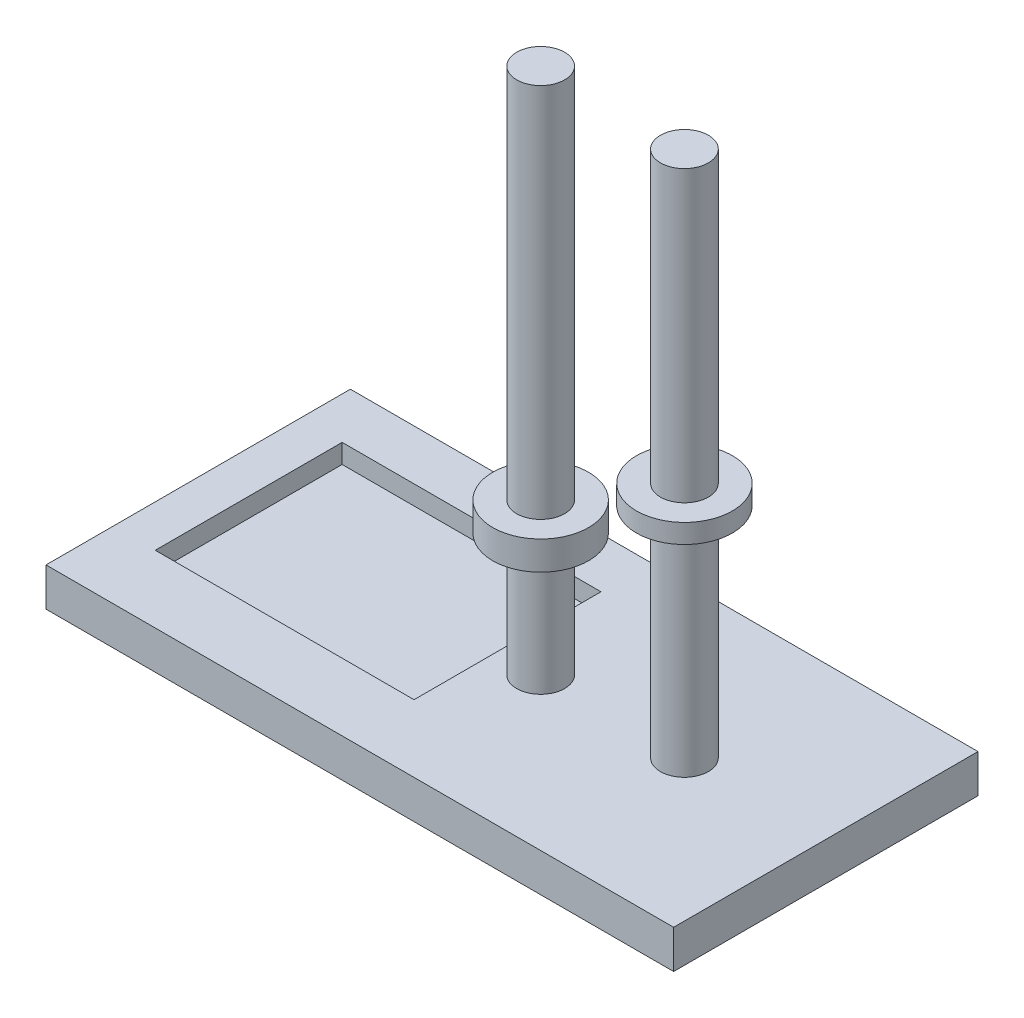
ISO-10303-21;
HEADER;
FILE_DESCRIPTION(('STEP AP214'),'2;1');
FILE_NAME('part.step','',(''),(''),'','','');
FILE_SCHEMA(('AUTOMOTIVE_DESIGN { 1 0 10303 214 1 1 1 1 }'));
ENDSEC;
DATA;
#1=APPLICATION_CONTEXT('core data for automotive mechanical design processes');
#2=APPLICATION_PROTOCOL_DEFINITION('international standard','automotive_design',2000,#1);
#3=PRODUCT_CONTEXT('',#1,'mechanical');
#4=PRODUCT('Part','Part','',(#3));
#5=PRODUCT_RELATED_PRODUCT_CATEGORY('part','',(#4));
#6=PRODUCT_DEFINITION_FORMATION('','',#4);
#7=PRODUCT_DEFINITION_CONTEXT('part definition',#1,'design');
#8=PRODUCT_DEFINITION('design','',#6,#7);
#9=PRODUCT_DEFINITION_SHAPE('','',#8);
#10=(LENGTH_UNIT() NAMED_UNIT(*) SI_UNIT(.MILLI.,.METRE.));
#11=(NAMED_UNIT(*) PLANE_ANGLE_UNIT() SI_UNIT($,.RADIAN.));
#12=(NAMED_UNIT(*) SI_UNIT($,.STERADIAN.) SOLID_ANGLE_UNIT());
#13=UNCERTAINTY_MEASURE_WITH_UNIT(LENGTH_MEASURE(1.E-05),#10,'distance_accuracy_value','');
#14=(GEOMETRIC_REPRESENTATION_CONTEXT(3) GLOBAL_UNCERTAINTY_ASSIGNED_CONTEXT((#13)) GLOBAL_UNIT_ASSIGNED_CONTEXT((#10,
#11,#12)) REPRESENTATION_CONTEXT('',''));
#15=CARTESIAN_POINT('',(0.,0.,0.));
#16=DIRECTION('',(0.,0.,1.));
#17=DIRECTION('',(1.,0.,0.));
#18=AXIS2_PLACEMENT_3D('',#15,#16,#17);
#19=CARTESIAN_POINT('',(-3.03896860391102,55.,0.));
#20=DIRECTION('',(0.,-1.,0.));
#21=DIRECTION('',(0.,0.,-1.));
#22=AXIS2_PLACEMENT_3D('',#19,#20,#21);
#23=CYLINDRICAL_SURFACE('',#22,2.5);
#24=CARTESIAN_POINT('',(-3.03896860391102,0.,0.));
#25=DIRECTION('',(0.,1.,0.));
#26=DIRECTION('',(0.,0.,1.));
#27=AXIS2_PLACEMENT_3D('',#24,#25,#26);
#28=CIRCLE('',#27,2.5);
#29=CARTESIAN_POINT('',(-3.03896860391102,0.,2.5));
#30=VERTEX_POINT('',#29);
#31=EDGE_CURVE('E236',#30,#30,#28,.T.);
#32=ORIENTED_EDGE('',*,*,#31,.T.);
#33=EDGE_LOOP('',(#32));
#34=FACE_BOUND('',#33,.T.);
#35=CARTESIAN_POINT('',(-3.03896860391102,12.8,0.));
#36=DIRECTION('',(0.,1.,0.));
#37=DIRECTION('',(0.,0.,1.));
#38=AXIS2_PLACEMENT_3D('',#35,#36,#37);
#39=CIRCLE('',#38,2.5);
#40=CARTESIAN_POINT('',(-3.03896860391102,12.8,2.5));
#41=VERTEX_POINT('',#40);
#42=EDGE_CURVE('E12',#41,#41,#39,.T.);
#43=ORIENTED_EDGE('',*,*,#42,.F.);
#44=EDGE_LOOP('',(#43));
#45=FACE_BOUND('',#44,.T.);
#46=ADVANCED_FACE('F62',(#34,#45),#23,.T.);
#47=CARTESIAN_POINT('',(0.,0.,0.));
#48=DIRECTION('',(0.,1.,0.));
#49=DIRECTION('',(0.,0.,1.));
#50=AXIS2_PLACEMENT_3D('',#47,#48,#49);
#51=PLANE('',#50);
#52=DIRECTION('',(1.,0.,0.));
#53=VECTOR('',#52,1.);
#54=CARTESIAN_POINT('',(0.,0.,8.85554317938453));
#55=LINE('',#54,#53);
#56=CARTESIAN_POINT('',(-34.3925403184,0.,8.85554317938453));
#57=VERTEX_POINT('',#56);
#58=CARTESIAN_POINT('',(-7.39254031840001,0.,8.85554317938453));
#59=VERTEX_POINT('',#58);
#60=EDGE_CURVE('E78',#57,#59,#55,.T.);
#61=ORIENTED_EDGE('',*,*,#60,.F.);
#62=DIRECTION('',(0.,0.,-1.));
#63=VECTOR('',#62,1.);
#64=CARTESIAN_POINT('',(-34.3925403184,0.,0.));
#65=LINE('',#64,#63);
#66=CARTESIAN_POINT('',(-34.3925403184,0.,-10.6444568206155));
#67=VERTEX_POINT('',#66);
#68=EDGE_CURVE('E150',#57,#67,#65,.T.);
#69=ORIENTED_EDGE('',*,*,#68,.T.);
#70=DIRECTION('',(1.,0.,0.));
#71=VECTOR('',#70,1.);
#72=CARTESIAN_POINT('',(0.,0.,-10.6444568206155));
#73=LINE('',#72,#71);
#74=CARTESIAN_POINT('',(-7.39254031840001,0.,-10.6444568206155));
#75=VERTEX_POINT('',#74);
#76=EDGE_CURVE('E154',#67,#75,#73,.T.);
#77=ORIENTED_EDGE('',*,*,#76,.T.);
#78=DIRECTION('',(0.,0.,1.));
#79=VECTOR('',#78,1.);
#80=CARTESIAN_POINT('',(-7.39254031840001,0.,0.));
#81=LINE('',#80,#79);
#82=EDGE_CURVE('E163',#75,#59,#81,.T.);
#83=ORIENTED_EDGE('',*,*,#82,.T.);
#84=EDGE_LOOP('',(#61,#69,#77,#83));
#85=FACE_BOUND('',#84,.T.);
#86=CARTESIAN_POINT('',(11.961031396089,0.,0.));
#87=DIRECTION('',(0.,1.,0.));
#88=DIRECTION('',(0.,0.,1.));
#89=AXIS2_PLACEMENT_3D('',#86,#87,#88);
#90=CIRCLE('',#89,2.5);
#91=CARTESIAN_POINT('',(11.961031396089,0.,2.5));
#92=VERTEX_POINT('',#91);
#93=EDGE_CURVE('E240',#92,#92,#90,.T.);
#94=ORIENTED_EDGE('',*,*,#93,.F.);
#95=EDGE_LOOP('',(#94));
#96=FACE_BOUND('',#95,.T.);
#97=ORIENTED_EDGE('',*,*,#31,.F.);
#98=EDGE_LOOP('',(#97));
#99=FACE_BOUND('',#98,.T.);
#100=DIRECTION('',(-1.,0.,0.));
#101=VECTOR('',#100,1.);
#102=CARTESIAN_POINT('',(-38.7677968677662,0.,-15.8770260663382));
#103=LINE('',#102,#101);
#104=CARTESIAN_POINT('',(26.7095065927379,0.,-15.8770260663382));
#105=VERTEX_POINT('',#104);
#106=CARTESIAN_POINT('',(-38.7677968677662,0.,-15.8770260663382));
#107=VERTEX_POINT('',#106);
#108=EDGE_CURVE('E199',#105,#107,#103,.T.);
#109=ORIENTED_EDGE('',*,*,#108,.T.);
#110=DIRECTION('',(0.,0.,1.));
#111=VECTOR('',#110,1.);
#112=CARTESIAN_POINT('',(-38.7677968677662,0.,-15.8770260663382));
#113=LINE('',#112,#111);
#114=CARTESIAN_POINT('',(-38.7677968677662,0.,15.8770260663382));
#115=VERTEX_POINT('',#114);
#116=EDGE_CURVE('E187',#107,#115,#113,.T.);
#117=ORIENTED_EDGE('',*,*,#116,.T.);
#118=DIRECTION('',(1.,0.,0.));
#119=VECTOR('',#118,1.);
#120=CARTESIAN_POINT('',(-38.7677968677662,0.,15.8770260663382));
#121=LINE('',#120,#119);
#122=CARTESIAN_POINT('',(26.7095065927379,0.,15.8770260663382));
#123=VERTEX_POINT('',#122);
#124=EDGE_CURVE('E191',#115,#123,#121,.T.);
#125=ORIENTED_EDGE('',*,*,#124,.T.);
#126=DIRECTION('',(0.,0.,-1.));
#127=VECTOR('',#126,1.);
#128=CARTESIAN_POINT('',(26.7095065927379,0.,-15.8770260663382));
#129=LINE('',#128,#127);
#130=EDGE_CURVE('E195',#123,#105,#129,.T.);
#131=ORIENTED_EDGE('',*,*,#130,.T.);
#132=EDGE_LOOP('',(#109,#117,#125,#131));
#133=FACE_BOUND('',#132,.T.);
#134=ADVANCED_FACE('F64',(#85,#96,#99,#133),#51,.T.);
#135=CARTESIAN_POINT('',(11.961031396089,55.,0.));
#136=DIRECTION('',(0.,-1.,0.));
#137=DIRECTION('',(0.,0.,-1.));
#138=AXIS2_PLACEMENT_3D('',#135,#136,#137);
#139=CYLINDRICAL_SURFACE('',#138,2.5);
#140=ORIENTED_EDGE('',*,*,#93,.T.);
#141=EDGE_LOOP('',(#140));
#142=FACE_BOUND('',#141,.T.);
#143=CARTESIAN_POINT('',(11.961031396089,22.8,0.));
#144=DIRECTION('',(0.,1.,0.));
#145=DIRECTION('',(0.,0.,1.));
#146=AXIS2_PLACEMENT_3D('',#143,#144,#145);
#147=CIRCLE('',#146,2.5);
#148=CARTESIAN_POINT('',(11.961031396089,22.8,2.5));
#149=VERTEX_POINT('',#148);
#150=EDGE_CURVE('E71',#149,#149,#147,.T.);
#151=ORIENTED_EDGE('',*,*,#150,.F.);
#152=EDGE_LOOP('',(#151));
#153=FACE_BOUND('',#152,.T.);
#154=ADVANCED_FACE('F292',(#142,#153),#139,.T.);
#155=CARTESIAN_POINT('',(11.961031396089,22.8,0.));
#156=DIRECTION('',(0.,1.,0.));
#157=DIRECTION('',(0.,0.,1.));
#158=AXIS2_PLACEMENT_3D('',#155,#156,#157);
#159=CYLINDRICAL_SURFACE('',#158,5.);
#160=CARTESIAN_POINT('',(11.961031396089,22.8,0.));
#161=DIRECTION('',(0.,1.,0.));
#162=DIRECTION('',(0.,0.,1.));
#163=AXIS2_PLACEMENT_3D('',#160,#161,#162);
#164=CIRCLE('',#163,5.);
#165=CARTESIAN_POINT('',(11.961031396089,22.8,5.));
#166=VERTEX_POINT('',#165);
#167=EDGE_CURVE('E228',#166,#166,#164,.T.);
#168=ORIENTED_EDGE('',*,*,#167,.T.);
#169=EDGE_LOOP('',(#168));
#170=FACE_BOUND('',#169,.T.);
#171=CARTESIAN_POINT('',(11.961031396089,24.8,0.));
#172=DIRECTION('',(0.,1.,0.));
#173=DIRECTION('',(0.,0.,1.));
#174=AXIS2_PLACEMENT_3D('',#171,#172,#173);
#175=CIRCLE('',#174,5.);
#176=CARTESIAN_POINT('',(11.961031396089,24.8,5.));
#177=VERTEX_POINT('',#176);
#178=EDGE_CURVE('E227',#177,#177,#175,.T.);
#179=ORIENTED_EDGE('',*,*,#178,.F.);
#180=EDGE_LOOP('',(#179));
#181=FACE_BOUND('',#180,.T.);
#182=ADVANCED_FACE('F326',(#170,#181),#159,.T.);
#183=CARTESIAN_POINT('',(11.961031396089,22.8,0.));
#184=DIRECTION('',(0.,1.,0.));
#185=DIRECTION('',(0.,0.,1.));
#186=AXIS2_PLACEMENT_3D('',#183,#184,#185);
#187=PLANE('',#186);
#188=ORIENTED_EDGE('',*,*,#150,.T.);
#189=EDGE_LOOP('',(#188));
#190=FACE_BOUND('',#189,.T.);
#191=ORIENTED_EDGE('',*,*,#167,.F.);
#192=EDGE_LOOP('',(#191));
#193=FACE_BOUND('',#192,.T.);
#194=ADVANCED_FACE('F331',(#190,#193),#187,.F.);
#195=CARTESIAN_POINT('',(11.961031396089,24.8,0.));
#196=DIRECTION('',(0.,1.,0.));
#197=DIRECTION('',(0.,0.,1.));
#198=AXIS2_PLACEMENT_3D('',#195,#196,#197);
#199=PLANE('',#198);
#200=CARTESIAN_POINT('',(11.961031396089,24.8,0.));
#201=DIRECTION('',(0.,1.,0.));
#202=DIRECTION('',(0.,0.,1.));
#203=AXIS2_PLACEMENT_3D('',#200,#201,#202);
#204=CIRCLE('',#203,2.5);
#205=CARTESIAN_POINT('',(11.961031396089,24.8,2.5));
#206=VERTEX_POINT('',#205);
#207=EDGE_CURVE('E232',#206,#206,#204,.T.);
#208=ORIENTED_EDGE('',*,*,#207,.F.);
#209=EDGE_LOOP('',(#208));
#210=FACE_BOUND('',#209,.T.);
#211=ORIENTED_EDGE('',*,*,#178,.T.);
#212=EDGE_LOOP('',(#211));
#213=FACE_BOUND('',#212,.T.);
#214=ADVANCED_FACE('F313',(#210,#213),#199,.T.);
#215=CARTESIAN_POINT('',(0.,55.,0.));
#216=DIRECTION('',(0.,1.,0.));
#217=DIRECTION('',(0.,0.,1.));
#218=AXIS2_PLACEMENT_3D('',#215,#216,#217);
#219=PLANE('',#218);
#220=CARTESIAN_POINT('',(11.961031396089,55.,0.));
#221=DIRECTION('',(0.,1.,0.));
#222=DIRECTION('',(0.,0.,1.));
#223=AXIS2_PLACEMENT_3D('',#220,#221,#222);
#224=CIRCLE('',#223,2.5);
#225=CARTESIAN_POINT('',(11.961031396089,55.,2.5));
#226=VERTEX_POINT('',#225);
#227=EDGE_CURVE('E245',#226,#226,#224,.T.);
#228=ORIENTED_EDGE('',*,*,#227,.T.);
#229=EDGE_LOOP('',(#228));
#230=FACE_BOUND('',#229,.T.);
#231=ADVANCED_FACE('F310',(#230),#219,.T.);
#232=ORIENTED_EDGE('',*,*,#207,.T.);
#233=EDGE_LOOP('',(#232));
#234=FACE_BOUND('',#233,.T.);
#235=ORIENTED_EDGE('',*,*,#227,.F.);
#236=EDGE_LOOP('',(#235));
#237=FACE_BOUND('',#236,.T.);
#238=ADVANCED_FACE('F312',(#234,#237),#139,.T.);
#239=CARTESIAN_POINT('',(-38.7677968677662,-10.,-15.8770260663382));
#240=DIRECTION('',(-1.,0.,0.));
#241=DIRECTION('',(0.,0.,1.));
#242=AXIS2_PLACEMENT_3D('',#239,#240,#241);
#243=PLANE('',#242);
#244=DIRECTION('',(0.,0.,1.));
#245=VECTOR('',#244,1.);
#246=CARTESIAN_POINT('',(-38.7677968677662,-4.,0.));
#247=LINE('',#246,#245);
#248=CARTESIAN_POINT('',(-38.7677968677662,-4.,-15.8770260663382));
#249=VERTEX_POINT('',#248);
#250=CARTESIAN_POINT('',(-38.7677968677662,-4.,15.8770260663382));
#251=VERTEX_POINT('',#250);
#252=EDGE_CURVE('E224',#249,#251,#247,.T.);
#253=ORIENTED_EDGE('',*,*,#252,.T.);
#254=DIRECTION('',(0.,1.,0.));
#255=VECTOR('',#254,1.);
#256=CARTESIAN_POINT('',(-38.7677968677662,-10.,15.8770260663382));
#257=LINE('',#256,#255);
#258=EDGE_CURVE('E86',#251,#115,#257,.T.);
#259=ORIENTED_EDGE('',*,*,#258,.T.);
#260=ORIENTED_EDGE('',*,*,#116,.F.);
#261=DIRECTION('',(0.,1.,0.));
#262=VECTOR('',#261,1.);
#263=CARTESIAN_POINT('',(-38.7677968677662,-10.,-15.8770260663382));
#264=LINE('',#263,#262);
#265=EDGE_CURVE('E203',#249,#107,#264,.T.);
#266=ORIENTED_EDGE('',*,*,#265,.F.);
#267=EDGE_LOOP('',(#253,#259,#260,#266));
#268=FACE_BOUND('',#267,.T.);
#269=ADVANCED_FACE('F316',(#268),#243,.T.);
#270=CARTESIAN_POINT('',(-38.7677968677662,-10.,-15.8770260663382));
#271=DIRECTION('',(0.,0.,-1.));
#272=DIRECTION('',(-1.,0.,0.));
#273=AXIS2_PLACEMENT_3D('',#270,#271,#272);
#274=PLANE('',#273);
#275=DIRECTION('',(-1.,0.,0.));
#276=VECTOR('',#275,1.);
#277=CARTESIAN_POINT('',(0.,-4.,-15.8770260663382));
#278=LINE('',#277,#276);
#279=CARTESIAN_POINT('',(26.7095065927379,-4.,-15.8770260663382));
#280=VERTEX_POINT('',#279);
#281=EDGE_CURVE('E221',#280,#249,#278,.T.);
#282=ORIENTED_EDGE('',*,*,#281,.T.);
#283=ORIENTED_EDGE('',*,*,#265,.T.);
#284=ORIENTED_EDGE('',*,*,#108,.F.);
#285=DIRECTION('',(0.,1.,0.));
#286=VECTOR('',#285,1.);
#287=CARTESIAN_POINT('',(26.7095065927379,-10.,-15.8770260663382));
#288=LINE('',#287,#286);
#289=EDGE_CURVE('E207',#280,#105,#288,.T.);
#290=ORIENTED_EDGE('',*,*,#289,.F.);
#291=EDGE_LOOP('',(#282,#283,#284,#290));
#292=FACE_BOUND('',#291,.T.);
#293=ADVANCED_FACE('F322',(#292),#274,.T.);
#294=CARTESIAN_POINT('',(26.7095065927379,-10.,-15.8770260663382));
#295=DIRECTION('',(1.,0.,0.));
#296=DIRECTION('',(0.,0.,-1.));
#297=AXIS2_PLACEMENT_3D('',#294,#295,#296);
#298=PLANE('',#297);
#299=DIRECTION('',(0.,0.,-1.));
#300=VECTOR('',#299,1.);
#301=CARTESIAN_POINT('',(26.7095065927379,-4.,0.));
#302=LINE('',#301,#300);
#303=CARTESIAN_POINT('',(26.7095065927379,-4.,15.8770260663382));
#304=VERTEX_POINT('',#303);
#305=EDGE_CURVE('E218',#304,#280,#302,.T.);
#306=ORIENTED_EDGE('',*,*,#305,.T.);
#307=ORIENTED_EDGE('',*,*,#289,.T.);
#308=ORIENTED_EDGE('',*,*,#130,.F.);
#309=DIRECTION('',(0.,1.,0.));
#310=VECTOR('',#309,1.);
#311=CARTESIAN_POINT('',(26.7095065927379,-10.,15.8770260663382));
#312=LINE('',#311,#310);
#313=EDGE_CURVE('E210',#304,#123,#312,.T.);
#314=ORIENTED_EDGE('',*,*,#313,.F.);
#315=EDGE_LOOP('',(#306,#307,#308,#314));
#316=FACE_BOUND('',#315,.T.);
#317=ADVANCED_FACE('F352',(#316),#298,.T.);
#318=CARTESIAN_POINT('',(-38.7677968677662,-10.,15.8770260663382));
#319=DIRECTION('',(0.,0.,1.));
#320=DIRECTION('',(1.,0.,0.));
#321=AXIS2_PLACEMENT_3D('',#318,#319,#320);
#322=PLANE('',#321);
#323=DIRECTION('',(1.,0.,0.));
#324=VECTOR('',#323,1.);
#325=CARTESIAN_POINT('',(0.,-4.,15.8770260663382));
#326=LINE('',#325,#324);
#327=EDGE_CURVE('E206',#251,#304,#326,.T.);
#328=ORIENTED_EDGE('',*,*,#327,.T.);
#329=ORIENTED_EDGE('',*,*,#313,.T.);
#330=ORIENTED_EDGE('',*,*,#124,.F.);
#331=ORIENTED_EDGE('',*,*,#258,.F.);
#332=EDGE_LOOP('',(#328,#329,#330,#331));
#333=FACE_BOUND('',#332,.T.);
#334=ADVANCED_FACE('F284',(#333),#322,.T.);
#335=CARTESIAN_POINT('',(0.,-4.,0.));
#336=DIRECTION('',(0.,1.,0.));
#337=DIRECTION('',(0.,0.,1.));
#338=AXIS2_PLACEMENT_3D('',#335,#336,#337);
#339=PLANE('',#338);
#340=ORIENTED_EDGE('',*,*,#252,.F.);
#341=ORIENTED_EDGE('',*,*,#281,.F.);
#342=ORIENTED_EDGE('',*,*,#305,.F.);
#343=ORIENTED_EDGE('',*,*,#327,.F.);
#344=EDGE_LOOP('',(#340,#341,#342,#343));
#345=FACE_BOUND('',#344,.T.);
#346=ADVANCED_FACE('F274',(#345),#339,.F.);
#347=CARTESIAN_POINT('',(-3.03896860391102,12.8,0.));
#348=DIRECTION('',(0.,1.,0.));
#349=DIRECTION('',(0.,0.,1.));
#350=AXIS2_PLACEMENT_3D('',#347,#348,#349);
#351=CYLINDRICAL_SURFACE('',#350,5.);
#352=CARTESIAN_POINT('',(-3.03896860391102,12.8,0.));
#353=DIRECTION('',(0.,1.,0.));
#354=DIRECTION('',(0.,0.,1.));
#355=AXIS2_PLACEMENT_3D('',#352,#353,#354);
#356=CIRCLE('',#355,5.);
#357=CARTESIAN_POINT('',(-3.03896860391102,12.8,5.));
#358=VERTEX_POINT('',#357);
#359=EDGE_CURVE('E179',#358,#358,#356,.T.);
#360=ORIENTED_EDGE('',*,*,#359,.T.);
#361=EDGE_LOOP('',(#360));
#362=FACE_BOUND('',#361,.T.);
#363=CARTESIAN_POINT('',(-3.03896860391102,15.8,0.));
#364=DIRECTION('',(0.,1.,0.));
#365=DIRECTION('',(0.,0.,1.));
#366=AXIS2_PLACEMENT_3D('',#363,#364,#365);
#367=CIRCLE('',#366,5.);
#368=CARTESIAN_POINT('',(-3.03896860391102,15.8,5.));
#369=VERTEX_POINT('',#368);
#370=EDGE_CURVE('E172',#369,#369,#367,.T.);
#371=ORIENTED_EDGE('',*,*,#370,.F.);
#372=EDGE_LOOP('',(#371));
#373=FACE_BOUND('',#372,.T.);
#374=ADVANCED_FACE('F272',(#362,#373),#351,.T.);
#375=CARTESIAN_POINT('',(-3.03896860391102,12.8,0.));
#376=DIRECTION('',(0.,1.,0.));
#377=DIRECTION('',(0.,0.,1.));
#378=AXIS2_PLACEMENT_3D('',#375,#376,#377);
#379=PLANE('',#378);
#380=ORIENTED_EDGE('',*,*,#42,.T.);
#381=EDGE_LOOP('',(#380));
#382=FACE_BOUND('',#381,.T.);
#383=ORIENTED_EDGE('',*,*,#359,.F.);
#384=EDGE_LOOP('',(#383));
#385=FACE_BOUND('',#384,.T.);
#386=ADVANCED_FACE('F268',(#382,#385),#379,.F.);
#387=CARTESIAN_POINT('',(-3.03896860391102,15.8,0.));
#388=DIRECTION('',(0.,1.,0.));
#389=DIRECTION('',(0.,0.,1.));
#390=AXIS2_PLACEMENT_3D('',#387,#388,#389);
#391=PLANE('',#390);
#392=CARTESIAN_POINT('',(-3.03896860391102,15.8,0.));
#393=DIRECTION('',(0.,1.,0.));
#394=DIRECTION('',(0.,0.,1.));
#395=AXIS2_PLACEMENT_3D('',#392,#393,#394);
#396=CIRCLE('',#395,2.5);
#397=CARTESIAN_POINT('',(-3.03896860391102,15.8,2.5));
#398=VERTEX_POINT('',#397);
#399=EDGE_CURVE('E183',#398,#398,#396,.T.);
#400=ORIENTED_EDGE('',*,*,#399,.F.);
#401=EDGE_LOOP('',(#400));
#402=FACE_BOUND('',#401,.T.);
#403=ORIENTED_EDGE('',*,*,#370,.T.);
#404=EDGE_LOOP('',(#403));
#405=FACE_BOUND('',#404,.T.);
#406=ADVANCED_FACE('F264',(#402,#405),#391,.T.);
#407=CARTESIAN_POINT('',(-3.03896860391102,55.,0.));
#408=DIRECTION('',(0.,1.,0.));
#409=DIRECTION('',(0.,0.,1.));
#410=AXIS2_PLACEMENT_3D('',#407,#408,#409);
#411=PLANE('',#410);
#412=CARTESIAN_POINT('',(-3.03896860391102,55.,0.));
#413=DIRECTION('',(0.,1.,0.));
#414=DIRECTION('',(0.,0.,1.));
#415=AXIS2_PLACEMENT_3D('',#412,#413,#414);
#416=CIRCLE('',#415,2.5);
#417=CARTESIAN_POINT('',(-3.03896860391102,55.,2.5));
#418=VERTEX_POINT('',#417);
#419=EDGE_CURVE('E241',#418,#418,#416,.T.);
#420=ORIENTED_EDGE('',*,*,#419,.T.);
#421=EDGE_LOOP('',(#420));
#422=FACE_BOUND('',#421,.T.);
#423=ADVANCED_FACE('F267',(#422),#411,.T.);
#424=ORIENTED_EDGE('',*,*,#399,.T.);
#425=EDGE_LOOP('',(#424));
#426=FACE_BOUND('',#425,.T.);
#427=ORIENTED_EDGE('',*,*,#419,.F.);
#428=EDGE_LOOP('',(#427));
#429=FACE_BOUND('',#428,.T.);
#430=ADVANCED_FACE('F261',(#426,#429),#23,.T.);
#431=CARTESIAN_POINT('',(0.,-2.,8.85554317938453));
#432=DIRECTION('',(0.,0.,1.));
#433=DIRECTION('',(1.,0.,0.));
#434=AXIS2_PLACEMENT_3D('',#431,#432,#433);
#435=PLANE('',#434);
#436=ORIENTED_EDGE('',*,*,#60,.T.);
#437=DIRECTION('',(0.,1.,0.));
#438=VECTOR('',#437,1.);
#439=CARTESIAN_POINT('',(-7.39254031840001,-2.,8.85554317938453));
#440=LINE('',#439,#438);
#441=CARTESIAN_POINT('',(-7.39254031840001,-2.,8.85554317938453));
#442=VERTEX_POINT('',#441);
#443=EDGE_CURVE('E130',#442,#59,#440,.T.);
#444=ORIENTED_EDGE('',*,*,#443,.F.);
#445=DIRECTION('',(1.,0.,0.));
#446=VECTOR('',#445,1.);
#447=CARTESIAN_POINT('',(0.,-2.,8.85554317938453));
#448=LINE('',#447,#446);
#449=CARTESIAN_POINT('',(-34.3925403184,-2.,8.85554317938453));
#450=VERTEX_POINT('',#449);
#451=EDGE_CURVE('E139',#450,#442,#448,.T.);
#452=ORIENTED_EDGE('',*,*,#451,.F.);
#453=DIRECTION('',(0.,1.,0.));
#454=VECTOR('',#453,1.);
#455=CARTESIAN_POINT('',(-34.3925403184,-2.,8.85554317938453));
#456=LINE('',#455,#454);
#457=EDGE_CURVE('E169',#450,#57,#456,.T.);
#458=ORIENTED_EDGE('',*,*,#457,.T.);
#459=EDGE_LOOP('',(#436,#444,#452,#458));
#460=FACE_BOUND('',#459,.T.);
#461=ADVANCED_FACE('F142',(#460),#435,.F.);
#462=CARTESIAN_POINT('',(-34.3925403184,-2.,0.));
#463=DIRECTION('',(1.,0.,0.));
#464=DIRECTION('',(0.,0.,-1.));
#465=AXIS2_PLACEMENT_3D('',#462,#463,#464);
#466=PLANE('',#465);
#467=ORIENTED_EDGE('',*,*,#68,.F.);
#468=ORIENTED_EDGE('',*,*,#457,.F.);
#469=DIRECTION('',(0.,0.,-1.));
#470=VECTOR('',#469,1.);
#471=CARTESIAN_POINT('',(-34.3925403184,-2.,0.));
#472=LINE('',#471,#470);
#473=CARTESIAN_POINT('',(-34.3925403184,-2.,-10.6444568206155));
#474=VERTEX_POINT('',#473);
#475=EDGE_CURVE('E144',#450,#474,#472,.T.);
#476=ORIENTED_EDGE('',*,*,#475,.T.);
#477=DIRECTION('',(0.,1.,0.));
#478=VECTOR('',#477,1.);
#479=CARTESIAN_POINT('',(-34.3925403184,-2.,-10.6444568206155));
#480=LINE('',#479,#478);
#481=EDGE_CURVE('E173',#474,#67,#480,.T.);
#482=ORIENTED_EDGE('',*,*,#481,.T.);
#483=EDGE_LOOP('',(#467,#468,#476,#482));
#484=FACE_BOUND('',#483,.T.);
#485=ADVANCED_FACE('F301',(#484),#466,.T.);
#486=CARTESIAN_POINT('',(0.,-2.,-10.6444568206155));
#487=DIRECTION('',(0.,0.,1.));
#488=DIRECTION('',(1.,0.,0.));
#489=AXIS2_PLACEMENT_3D('',#486,#487,#488);
#490=PLANE('',#489);
#491=ORIENTED_EDGE('',*,*,#76,.F.);
#492=ORIENTED_EDGE('',*,*,#481,.F.);
#493=DIRECTION('',(1.,0.,0.));
#494=VECTOR('',#493,1.);
#495=CARTESIAN_POINT('',(0.,-2.,-10.6444568206155));
#496=LINE('',#495,#494);
#497=CARTESIAN_POINT('',(-7.39254031840001,-2.,-10.6444568206155));
#498=VERTEX_POINT('',#497);
#499=EDGE_CURVE('E138',#474,#498,#496,.T.);
#500=ORIENTED_EDGE('',*,*,#499,.T.);
#501=DIRECTION('',(0.,1.,0.));
#502=VECTOR('',#501,1.);
#503=CARTESIAN_POINT('',(-7.39254031840001,-2.,-10.6444568206155));
#504=LINE('',#503,#502);
#505=EDGE_CURVE('E133',#498,#75,#504,.T.);
#506=ORIENTED_EDGE('',*,*,#505,.T.);
#507=EDGE_LOOP('',(#491,#492,#500,#506));
#508=FACE_BOUND('',#507,.T.);
#509=ADVANCED_FACE('F429',(#508),#490,.T.);
#510=CARTESIAN_POINT('',(-7.39254031840001,-2.,0.));
#511=DIRECTION('',(-1.,0.,0.));
#512=DIRECTION('',(0.,0.,1.));
#513=AXIS2_PLACEMENT_3D('',#510,#511,#512);
#514=PLANE('',#513);
#515=ORIENTED_EDGE('',*,*,#82,.F.);
#516=ORIENTED_EDGE('',*,*,#505,.F.);
#517=DIRECTION('',(0.,0.,1.));
#518=VECTOR('',#517,1.);
#519=CARTESIAN_POINT('',(-7.39254031840001,-2.,0.));
#520=LINE('',#519,#518);
#521=EDGE_CURVE('E128',#498,#442,#520,.T.);
#522=ORIENTED_EDGE('',*,*,#521,.T.);
#523=ORIENTED_EDGE('',*,*,#443,.T.);
#524=EDGE_LOOP('',(#515,#516,#522,#523));
#525=FACE_BOUND('',#524,.T.);
#526=ADVANCED_FACE('F129',(#525),#514,.T.);
#527=CARTESIAN_POINT('',(0.,-2.,0.));
#528=DIRECTION('',(0.,1.,0.));
#529=DIRECTION('',(0.,0.,1.));
#530=AXIS2_PLACEMENT_3D('',#527,#528,#529);
#531=PLANE('',#530);
#532=ORIENTED_EDGE('',*,*,#451,.T.);
#533=ORIENTED_EDGE('',*,*,#521,.F.);
#534=ORIENTED_EDGE('',*,*,#499,.F.);
#535=ORIENTED_EDGE('',*,*,#475,.F.);
#536=EDGE_LOOP('',(#532,#533,#534,#535));
#537=FACE_BOUND('',#536,.T.);
#538=ADVANCED_FACE('F147',(#537),#531,.T.);
#539=CLOSED_SHELL('',(#46,#134,#154,#182,#194,#214,#231,#238,#269,#293,#317,#334,#346,#374,#386,
#406,#423,#430,#461,#485,#509,#526,#538));
#540=MANIFOLD_SOLID_BREP('B2',#539);
#541=ADVANCED_BREP_SHAPE_REPRESENTATION('',(#18,#540),#14);
#542=SHAPE_DEFINITION_REPRESENTATION(#9,#541);
ENDSEC;
END-ISO-10303-21;
